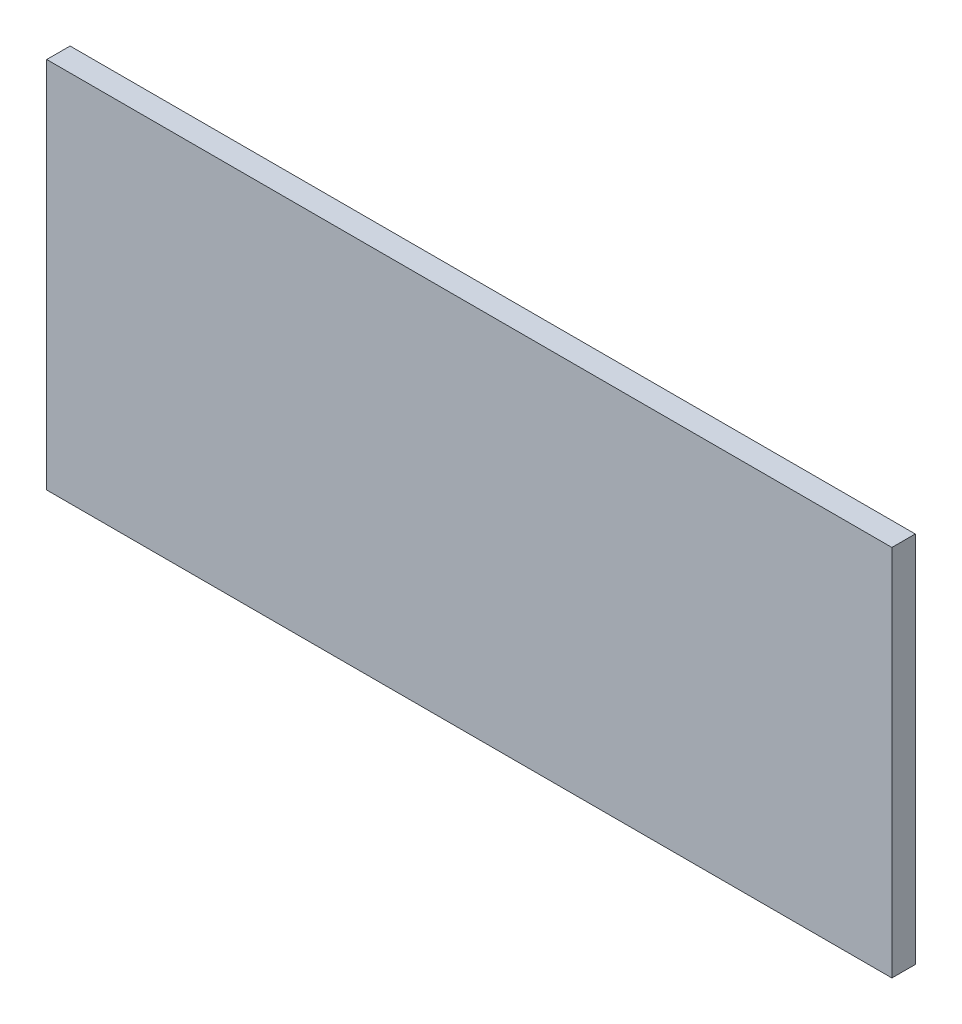
ISO-10303-21;
HEADER;
FILE_DESCRIPTION(('STEP AP214'),'2;1');
FILE_NAME('part.step','',(''),(''),'','','');
FILE_SCHEMA(('AUTOMOTIVE_DESIGN { 1 0 10303 214 1 1 1 1 }'));
ENDSEC;
DATA;
#1=APPLICATION_CONTEXT('core data for automotive mechanical design processes');
#2=APPLICATION_PROTOCOL_DEFINITION('international standard','automotive_design',2000,#1);
#3=PRODUCT_CONTEXT('',#1,'mechanical');
#4=PRODUCT('Part','Part','',(#3));
#5=PRODUCT_RELATED_PRODUCT_CATEGORY('part','',(#4));
#6=PRODUCT_DEFINITION_FORMATION('','',#4);
#7=PRODUCT_DEFINITION_CONTEXT('part definition',#1,'design');
#8=PRODUCT_DEFINITION('design','',#6,#7);
#9=PRODUCT_DEFINITION_SHAPE('','',#8);
#10=(LENGTH_UNIT() NAMED_UNIT(*) SI_UNIT(.MILLI.,.METRE.));
#11=(NAMED_UNIT(*) PLANE_ANGLE_UNIT() SI_UNIT($,.RADIAN.));
#12=(NAMED_UNIT(*) SI_UNIT($,.STERADIAN.) SOLID_ANGLE_UNIT());
#13=UNCERTAINTY_MEASURE_WITH_UNIT(LENGTH_MEASURE(1.E-05),#10,'distance_accuracy_value','');
#14=(GEOMETRIC_REPRESENTATION_CONTEXT(3) GLOBAL_UNCERTAINTY_ASSIGNED_CONTEXT((#13)) GLOBAL_UNIT_ASSIGNED_CONTEXT((#10,
#11,#12)) REPRESENTATION_CONTEXT('',''));
#15=CARTESIAN_POINT('',(0.,0.,0.));
#16=DIRECTION('',(0.,0.,1.));
#17=DIRECTION('',(1.,0.,0.));
#18=AXIS2_PLACEMENT_3D('',#15,#16,#17);
#19=CARTESIAN_POINT('',(215.9,-95.25,11.938));
#20=DIRECTION('',(-1.,0.,0.));
#21=DIRECTION('',(0.,0.,1.));
#22=AXIS2_PLACEMENT_3D('',#19,#20,#21);
#23=PLANE('',#22);
#24=DIRECTION('',(0.,1.,0.));
#25=VECTOR('',#24,1.);
#26=CARTESIAN_POINT('',(215.9,-95.25,0.));
#27=LINE('',#26,#25);
#28=CARTESIAN_POINT('',(215.9,-95.25,0.));
#29=VERTEX_POINT('',#28);
#30=CARTESIAN_POINT('',(215.9,95.25,0.));
#31=VERTEX_POINT('',#30);
#32=EDGE_CURVE('E96',#29,#31,#27,.T.);
#33=ORIENTED_EDGE('',*,*,#32,.T.);
#34=DIRECTION('',(0.,0.,-1.));
#35=VECTOR('',#34,1.);
#36=CARTESIAN_POINT('',(215.9,95.25,11.938));
#37=LINE('',#36,#35);
#38=CARTESIAN_POINT('',(215.9,95.25,11.938));
#39=VERTEX_POINT('',#38);
#40=EDGE_CURVE('E11',#39,#31,#37,.T.);
#41=ORIENTED_EDGE('',*,*,#40,.F.);
#42=DIRECTION('',(0.,1.,0.));
#43=VECTOR('',#42,1.);
#44=CARTESIAN_POINT('',(215.9,-95.25,11.938));
#45=LINE('',#44,#43);
#46=CARTESIAN_POINT('',(215.9,-95.25,11.938));
#47=VERTEX_POINT('',#46);
#48=EDGE_CURVE('E84',#47,#39,#45,.T.);
#49=ORIENTED_EDGE('',*,*,#48,.F.);
#50=DIRECTION('',(0.,0.,-1.));
#51=VECTOR('',#50,1.);
#52=CARTESIAN_POINT('',(215.9,-95.25,11.938));
#53=LINE('',#52,#51);
#54=EDGE_CURVE('E92',#47,#29,#53,.T.);
#55=ORIENTED_EDGE('',*,*,#54,.T.);
#56=EDGE_LOOP('',(#33,#41,#49,#55));
#57=FACE_BOUND('',#56,.T.);
#58=ADVANCED_FACE('F33',(#57),#23,.F.);
#59=CARTESIAN_POINT('',(-215.9,95.25,11.938));
#60=DIRECTION('',(0.,-1.,0.));
#61=DIRECTION('',(0.,0.,-1.));
#62=AXIS2_PLACEMENT_3D('',#59,#60,#61);
#63=PLANE('',#62);
#64=DIRECTION('',(-1.,0.,0.));
#65=VECTOR('',#64,1.);
#66=CARTESIAN_POINT('',(-215.9,95.25,0.));
#67=LINE('',#66,#65);
#68=CARTESIAN_POINT('',(-215.9,95.25,0.));
#69=VERTEX_POINT('',#68);
#70=EDGE_CURVE('E88',#31,#69,#67,.T.);
#71=ORIENTED_EDGE('',*,*,#70,.T.);
#72=DIRECTION('',(0.,0.,-1.));
#73=VECTOR('',#72,1.);
#74=CARTESIAN_POINT('',(-215.9,95.25,11.938));
#75=LINE('',#74,#73);
#76=CARTESIAN_POINT('',(-215.9,95.25,11.938));
#77=VERTEX_POINT('',#76);
#78=EDGE_CURVE('E41',#77,#69,#75,.T.);
#79=ORIENTED_EDGE('',*,*,#78,.F.);
#80=DIRECTION('',(-1.,0.,0.));
#81=VECTOR('',#80,1.);
#82=CARTESIAN_POINT('',(-215.9,95.25,11.938));
#83=LINE('',#82,#81);
#84=EDGE_CURVE('E79',#39,#77,#83,.T.);
#85=ORIENTED_EDGE('',*,*,#84,.F.);
#86=ORIENTED_EDGE('',*,*,#40,.T.);
#87=EDGE_LOOP('',(#71,#79,#85,#86));
#88=FACE_BOUND('',#87,.T.);
#89=ADVANCED_FACE('F87',(#88),#63,.F.);
#90=CARTESIAN_POINT('',(-215.9,-95.25,11.938));
#91=DIRECTION('',(1.,0.,0.));
#92=DIRECTION('',(0.,0.,-1.));
#93=AXIS2_PLACEMENT_3D('',#90,#91,#92);
#94=PLANE('',#93);
#95=DIRECTION('',(0.,-1.,0.));
#96=VECTOR('',#95,1.);
#97=CARTESIAN_POINT('',(-215.9,-95.25,0.));
#98=LINE('',#97,#96);
#99=CARTESIAN_POINT('',(-215.9,-95.25,0.));
#100=VERTEX_POINT('',#99);
#101=EDGE_CURVE('E66',#69,#100,#98,.T.);
#102=ORIENTED_EDGE('',*,*,#101,.T.);
#103=DIRECTION('',(0.,0.,-1.));
#104=VECTOR('',#103,1.);
#105=CARTESIAN_POINT('',(-215.9,-95.25,11.938));
#106=LINE('',#105,#104);
#107=CARTESIAN_POINT('',(-215.9,-95.25,11.938));
#108=VERTEX_POINT('',#107);
#109=EDGE_CURVE('E89',#108,#100,#106,.T.);
#110=ORIENTED_EDGE('',*,*,#109,.F.);
#111=DIRECTION('',(0.,-1.,0.));
#112=VECTOR('',#111,1.);
#113=CARTESIAN_POINT('',(-215.9,-95.25,11.938));
#114=LINE('',#113,#112);
#115=EDGE_CURVE('E82',#77,#108,#114,.T.);
#116=ORIENTED_EDGE('',*,*,#115,.F.);
#117=ORIENTED_EDGE('',*,*,#78,.T.);
#118=EDGE_LOOP('',(#102,#110,#116,#117));
#119=FACE_BOUND('',#118,.T.);
#120=ADVANCED_FACE('F90',(#119),#94,.F.);
#121=CARTESIAN_POINT('',(-215.9,-95.25,11.938));
#122=DIRECTION('',(0.,1.,0.));
#123=DIRECTION('',(0.,0.,1.));
#124=AXIS2_PLACEMENT_3D('',#121,#122,#123);
#125=PLANE('',#124);
#126=DIRECTION('',(1.,0.,0.));
#127=VECTOR('',#126,1.);
#128=CARTESIAN_POINT('',(-215.9,-95.25,0.));
#129=LINE('',#128,#127);
#130=EDGE_CURVE('E72',#100,#29,#129,.T.);
#131=ORIENTED_EDGE('',*,*,#130,.T.);
#132=ORIENTED_EDGE('',*,*,#54,.F.);
#133=DIRECTION('',(1.,0.,0.));
#134=VECTOR('',#133,1.);
#135=CARTESIAN_POINT('',(-215.9,-95.25,11.938));
#136=LINE('',#135,#134);
#137=EDGE_CURVE('E49',#108,#47,#136,.T.);
#138=ORIENTED_EDGE('',*,*,#137,.F.);
#139=ORIENTED_EDGE('',*,*,#109,.T.);
#140=EDGE_LOOP('',(#131,#132,#138,#139));
#141=FACE_BOUND('',#140,.T.);
#142=ADVANCED_FACE('F103',(#141),#125,.F.);
#143=CARTESIAN_POINT('',(0.,0.,11.938));
#144=DIRECTION('',(0.,0.,-1.));
#145=DIRECTION('',(-1.,0.,0.));
#146=AXIS2_PLACEMENT_3D('',#143,#144,#145);
#147=PLANE('',#146);
#148=ORIENTED_EDGE('',*,*,#48,.T.);
#149=ORIENTED_EDGE('',*,*,#84,.T.);
#150=ORIENTED_EDGE('',*,*,#115,.T.);
#151=ORIENTED_EDGE('',*,*,#137,.T.);
#152=EDGE_LOOP('',(#148,#149,#150,#151));
#153=FACE_BOUND('',#152,.T.);
#154=ADVANCED_FACE('F80',(#153),#147,.F.);
#155=CARTESIAN_POINT('',(0.,0.,0.));
#156=DIRECTION('',(0.,0.,-1.));
#157=DIRECTION('',(-1.,0.,0.));
#158=AXIS2_PLACEMENT_3D('',#155,#156,#157);
#159=PLANE('',#158);
#160=ORIENTED_EDGE('',*,*,#32,.F.);
#161=ORIENTED_EDGE('',*,*,#130,.F.);
#162=ORIENTED_EDGE('',*,*,#101,.F.);
#163=ORIENTED_EDGE('',*,*,#70,.F.);
#164=EDGE_LOOP('',(#160,#161,#162,#163));
#165=FACE_BOUND('',#164,.T.);
#166=ADVANCED_FACE('F106',(#165),#159,.T.);
#167=CLOSED_SHELL('',(#58,#89,#120,#142,#154,#166));
#168=MANIFOLD_SOLID_BREP('B2',#167);
#169=ADVANCED_BREP_SHAPE_REPRESENTATION('',(#18,#168),#14);
#170=SHAPE_DEFINITION_REPRESENTATION(#9,#169);
ENDSEC;
END-ISO-10303-21;
